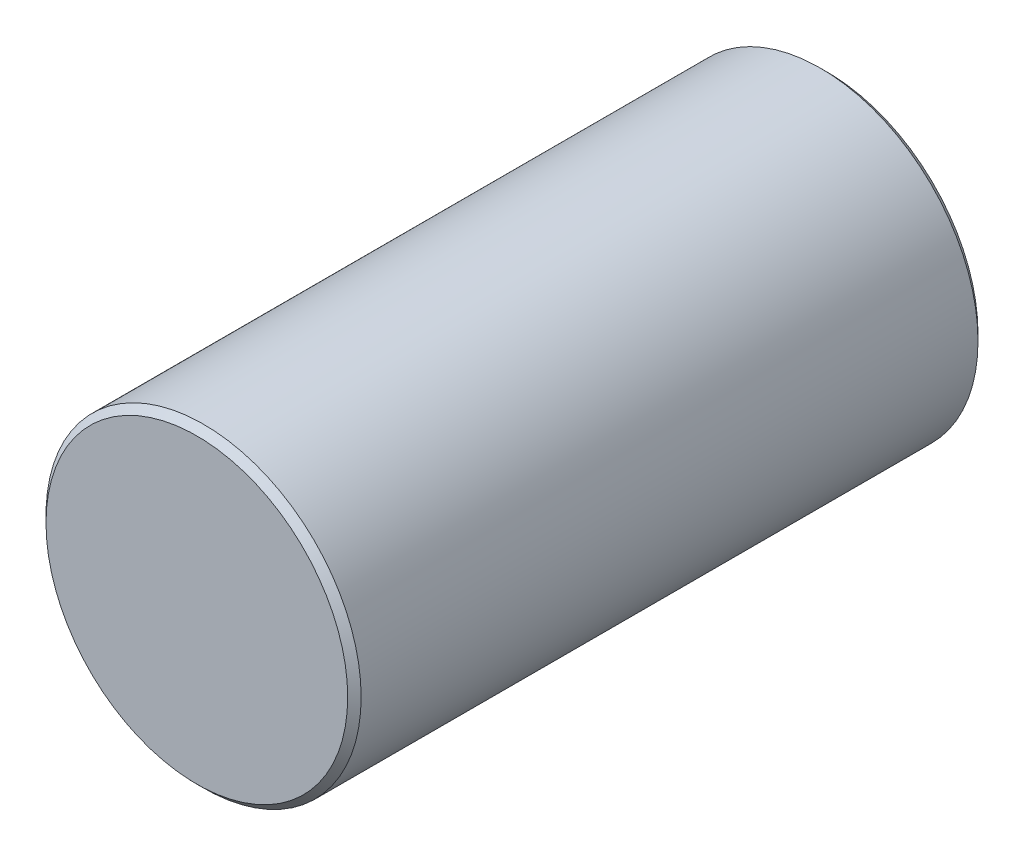
ISO-10303-21;
HEADER;
FILE_DESCRIPTION(('STEP AP214'),'2;1');
FILE_NAME('part.step','',(''),(''),'','','');
FILE_SCHEMA(('AUTOMOTIVE_DESIGN { 1 0 10303 214 1 1 1 1 }'));
ENDSEC;
DATA;
#1=APPLICATION_CONTEXT('core data for automotive mechanical design processes');
#2=APPLICATION_PROTOCOL_DEFINITION('international standard','automotive_design',2000,#1);
#3=PRODUCT_CONTEXT('',#1,'mechanical');
#4=PRODUCT('Part','Part','',(#3));
#5=PRODUCT_RELATED_PRODUCT_CATEGORY('part','',(#4));
#6=PRODUCT_DEFINITION_FORMATION('','',#4);
#7=PRODUCT_DEFINITION_CONTEXT('part definition',#1,'design');
#8=PRODUCT_DEFINITION('design','',#6,#7);
#9=PRODUCT_DEFINITION_SHAPE('','',#8);
#10=(LENGTH_UNIT() NAMED_UNIT(*) SI_UNIT(.MILLI.,.METRE.));
#11=(NAMED_UNIT(*) PLANE_ANGLE_UNIT() SI_UNIT($,.RADIAN.));
#12=(NAMED_UNIT(*) SI_UNIT($,.STERADIAN.) SOLID_ANGLE_UNIT());
#13=UNCERTAINTY_MEASURE_WITH_UNIT(LENGTH_MEASURE(1.E-05),#10,'distance_accuracy_value','');
#14=(GEOMETRIC_REPRESENTATION_CONTEXT(3) GLOBAL_UNCERTAINTY_ASSIGNED_CONTEXT((#13)) GLOBAL_UNIT_ASSIGNED_CONTEXT((#10,
#11,#12)) REPRESENTATION_CONTEXT('',''));
#15=CARTESIAN_POINT('',(0.,0.,0.));
#16=DIRECTION('',(0.,0.,1.));
#17=DIRECTION('',(1.,0.,0.));
#18=AXIS2_PLACEMENT_3D('',#15,#16,#17);
#19=CARTESIAN_POINT('',(0.,0.,19.05));
#20=DIRECTION('',(0.,0.,-1.));
#21=DIRECTION('',(-1.,0.,0.));
#22=AXIS2_PLACEMENT_3D('',#19,#20,#21);
#23=CYLINDRICAL_SURFACE('',#22,9.525);
#24=CARTESIAN_POINT('',(0.,0.,-18.6435999999999));
#25=DIRECTION('',(0.,0.,1.));
#26=DIRECTION('',(1.,0.,0.));
#27=AXIS2_PLACEMENT_3D('',#24,#25,#26);
#28=CIRCLE('',#27,9.525);
#29=CARTESIAN_POINT('',(9.525,0.,-18.6435999999999));
#30=VERTEX_POINT('',#29);
#31=EDGE_CURVE('E84',#30,#30,#28,.T.);
#32=ORIENTED_EDGE('',*,*,#31,.T.);
#33=EDGE_LOOP('',(#32));
#34=FACE_BOUND('',#33,.T.);
#35=CARTESIAN_POINT('',(0.,0.,18.6436));
#36=DIRECTION('',(0.,0.,1.));
#37=DIRECTION('',(1.,0.,0.));
#38=AXIS2_PLACEMENT_3D('',#35,#36,#37);
#39=CIRCLE('',#38,9.525);
#40=CARTESIAN_POINT('',(9.525,0.,18.6436));
#41=VERTEX_POINT('',#40);
#42=EDGE_CURVE('E88',#41,#41,#39,.F.);
#43=ORIENTED_EDGE('',*,*,#42,.T.);
#44=EDGE_LOOP('',(#43));
#45=FACE_BOUND('',#44,.T.);
#46=CARTESIAN_POINT('',(0.,-9.525,10.715625));
#47=CARTESIAN_POINT('',(0.110186853701386,-9.52499796048559,10.7156289329824));
#48=CARTESIAN_POINT('',(0.22042245336439,-9.5230684693038,10.7248335568285));
#49=CARTESIAN_POINT('',(0.437771089573852,-9.51555756572704,10.7613757173834));
#50=CARTESIAN_POINT('',(0.544881689203696,-9.50997337887931,10.7887270303211));
#51=CARTESIAN_POINT('',(0.752806997512505,-9.4957758584897,10.8606755971884));
#52=CARTESIAN_POINT('',(0.85362785952583,-9.48716554196074,10.9052556786482));
#53=CARTESIAN_POINT('',(1.04635352166196,-9.4678488539815,11.0103437540592));
#54=CARTESIAN_POINT('',(1.13825872096074,-9.45714257643735,11.0708510344599));
#55=CARTESIAN_POINT('',(1.31189463984028,-9.43463473789133,11.2070139400527));
#56=CARTESIAN_POINT('',(1.39347613760826,-9.42282065534544,11.2828578019607));
#57=CARTESIAN_POINT('',(1.54285597062141,-9.39951856586761,11.4471365214722));
#58=CARTESIAN_POINT('',(1.61065316515057,-9.38803058598984,11.5355724200972));
#59=CARTESIAN_POINT('',(1.73118512787581,-9.36655865120051,11.7236112504163));
#60=CARTESIAN_POINT('',(1.78376349305533,-9.35659077965039,11.8233164353981));
#61=CARTESIAN_POINT('',(1.87136276965051,-9.33946634531907,12.0303884546893));
#62=CARTESIAN_POINT('',(1.9063855726613,-9.33230947967264,12.1377544621275));
#63=CARTESIAN_POINT('',(1.95739131212307,-9.3217444531547,12.3554890643973));
#64=CARTESIAN_POINT('',(1.97363711343668,-9.31828459008686,12.4657935204439));
#65=CARTESIAN_POINT('',(1.98744455278288,-9.31534984012429,12.6876124880444));
#66=CARTESIAN_POINT('',(1.98500826795315,-9.31587451021558,12.7991268636987));
#67=CARTESIAN_POINT('',(1.9617327897155,-9.3208026423169,13.0182636319106));
#68=CARTESIAN_POINT('',(1.94119667056943,-9.32514222216842,13.1259198677122));
#69=CARTESIAN_POINT('',(1.88278362853788,-9.33711044715307,13.3362247715613));
#70=CARTESIAN_POINT('',(1.84490581426693,-9.34473926135591,13.4388731819001));
#71=CARTESIAN_POINT('',(1.75260005102111,-9.36249066449262,13.6371127251104));
#72=CARTESIAN_POINT('',(1.69805354023101,-9.37263101634617,13.7326469957367));
#73=CARTESIAN_POINT('',(1.57404228509877,-9.3942517539202,13.9133194940257));
#74=CARTESIAN_POINT('',(1.50457568696685,-9.40573230607678,13.9984564277771));
#75=CARTESIAN_POINT('',(1.35108143795551,-9.4290154785123,14.1576646632151));
#76=CARTESIAN_POINT('',(1.26679552554168,-9.44082000579164,14.231486918124));
#77=CARTESIAN_POINT('',(1.08690932067122,-9.46321589927014,14.3639864520385));
#78=CARTESIAN_POINT('',(0.991308858478398,-9.473807247265,14.4226635038));
#79=CARTESIAN_POINT('',(0.791218796711317,-9.49261295121719,14.5232597544383));
#80=CARTESIAN_POINT('',(0.686713545808314,-9.50082300540034,14.5651486772503));
#81=CARTESIAN_POINT('',(0.471939335793291,-9.51390874410408,14.6307043314263));
#82=CARTESIAN_POINT('',(0.361671137519699,-9.51878486758734,14.6543734617548));
#83=CARTESIAN_POINT('',(0.14063958680007,-9.52459161904536,14.6824608751578));
#84=CARTESIAN_POINT('',(0.0299212881478024,-9.52559203490906,14.6872197071221));
#85=CARTESIAN_POINT('',(-0.190728280527878,-9.52372924201278,14.678271141924));
#86=CARTESIAN_POINT('',(-0.300659598327591,-9.52086626982693,14.66456487547));
#87=CARTESIAN_POINT('',(-0.515503107802709,-9.51164221904454,14.6193579001171));
#88=CARTESIAN_POINT('',(-0.620454043719558,-9.50531583928072,14.5880336169537));
#89=CARTESIAN_POINT('',(-0.823613171574869,-9.48987223247301,14.508673896581));
#90=CARTESIAN_POINT('',(-0.921820826434637,-9.48075478344518,14.4606371301253));
#91=CARTESIAN_POINT('',(-1.1101297122728,-9.46056720866508,14.3484911495479));
#92=CARTESIAN_POINT('',(-1.20010748590837,-9.44947300177074,14.2841790618091));
#93=CARTESIAN_POINT('',(-1.36811614534486,-9.42661577175788,14.1415776936164));
#94=CARTESIAN_POINT('',(-1.44614563118735,-9.41485267048736,14.0632867776137));
#95=CARTESIAN_POINT('',(-1.58937110473474,-9.3917456394356,13.893394271513));
#96=CARTESIAN_POINT('',(-1.65433239427825,-9.38041191775658,13.801593186771));
#97=CARTESIAN_POINT('',(-1.76791491538299,-9.35967141612591,13.6081828988106));
#98=CARTESIAN_POINT('',(-1.8165368272611,-9.35026455595258,13.5065741041792));
#99=CARTESIAN_POINT('',(-1.89574878729727,-9.33452699874015,13.2969616008766));
#100=CARTESIAN_POINT('',(-1.92643616852001,-9.32817973045691,13.1889959784992));
#101=CARTESIAN_POINT('',(-1.96919911155909,-9.31924705726644,12.9692931010935));
#102=CARTESIAN_POINT('',(-1.981277335768,-9.31666111423332,12.8575563879291));
#103=CARTESIAN_POINT('',(-1.98637408299083,-9.31557552852254,12.6358437259131));
#104=CARTESIAN_POINT('',(-1.97976398913577,-9.31699626185384,12.5258765385225));
#105=CARTESIAN_POINT('',(-1.94849599686026,-9.32358510017197,12.3086590108392));
#106=CARTESIAN_POINT('',(-1.92383827166848,-9.32875316919031,12.2014086444794));
#107=CARTESIAN_POINT('',(-1.85734670707629,-9.34221735260749,11.9929310371236));
#108=CARTESIAN_POINT('',(-1.81556211639869,-9.35050449250089,11.891687471202));
#109=CARTESIAN_POINT('',(-1.71604713463365,-9.36927745360246,11.6975909430577));
#110=CARTESIAN_POINT('',(-1.6583152632306,-9.37976347890167,11.6047387608324));
#111=CARTESIAN_POINT('',(-1.52729199135608,-9.40199382537444,11.4282194170114));
#112=CARTESIAN_POINT('',(-1.45373390103893,-9.41375774516092,11.3447526397531));
#113=CARTESIAN_POINT('',(-1.29369254550809,-9.4370817033835,11.1912249295032));
#114=CARTESIAN_POINT('',(-1.20720630864734,-9.44864169425996,11.121167087137));
#115=CARTESIAN_POINT('',(-1.02256340366848,-9.47041293219374,10.9956781400703));
#116=CARTESIAN_POINT('',(-0.92428365041514,-9.48060708766275,10.9404250331805));
#117=CARTESIAN_POINT('',(-0.719645252347545,-9.49832854734372,10.8473077623673));
#118=CARTESIAN_POINT('',(-0.613293766277749,-9.50585818189085,10.8094283950988));
#119=CARTESIAN_POINT('',(-0.422299277478917,-9.51599093403041,10.7592173082171));
#120=CARTESIAN_POINT('',(-0.338721055043087,-9.51934906612464,10.7429002134059));
#121=CARTESIAN_POINT('',(-0.170104870255252,-9.52385434553741,10.7211027413347));
#122=CARTESIAN_POINT('',(-0.085066961960084,-9.52500157455531,10.7156219636408));
#123=CARTESIAN_POINT('',(0.,-9.525,10.715625));
#124=B_SPLINE_CURVE_WITH_KNOTS('',3,(#46,#47,#48,#49,#50,#51,#52,#53,#54,#55,#56,#57,#58,#59,
#60,#61,#62,#63,#64,#65,#66,#67,#68,#69,#70,#71,#72,#73,#74,#75,#76,#77,#78,#79,#80,#81,#82,#83,
#84,#85,#86,#87,#88,#89,#90,#91,#92,#93,#94,#95,#96,#97,#98,#99,#100,#101,#102,#103,#104,#105,
#106,#107,#108,#109,#110,#111,#112,#113,#114,#115,#116,#117,#118,#119,#120,#121,#122,#123),
.UNSPECIFIED.,.T.,.F.,(4,2,2,2,2,2,2,2,2,2,2,2,2,2,2,2,2,2,2,2,2,2,2,2,2,2,2,2,2,2,2,2,2,2,2,2,
2,2,4),(0.,0.330249284101304,0.660749567351132,0.990921276385388,1.32107819599712,
1.65556448141145,1.9900784358846,2.32791713070946,2.66571941590716,2.99873313082144,
3.33170982067874,3.65921468004882,3.98673637548069,4.31664415461589,4.64659294784255,
4.98299623089302,5.31940456116671,5.65641687643214,5.99338481035162,6.32425613809685,
6.65510720589241,6.98270267529287,7.31032420633107,7.64225014593232,7.97421494696261,
8.31169381329072,8.64915862638953,8.98477454525852,9.32034244345019,9.64928891974524,
9.97823223871661,10.3062362358679,10.6342706904185,10.9683395191812,11.3024852549882,
11.6404844723223,11.9781873476315,12.2331573420768,12.4881179144526),.UNSPECIFIED.);
#125=CARTESIAN_POINT('',(0.,-9.525,10.715625));
#126=VERTEX_POINT('',#125);
#127=EDGE_CURVE('E42',#126,#126,#124,.T.);
#128=ORIENTED_EDGE('',*,*,#127,.F.);
#129=EDGE_LOOP('',(#128));
#130=FACE_BOUND('',#129,.T.);
#131=CARTESIAN_POINT('',(0.,-9.525,-14.684375));
#132=CARTESIAN_POINT('',(0.110186853701386,-9.52499796048559,-14.6843710670176));
#133=CARTESIAN_POINT('',(0.22042245336439,-9.5230684693038,-14.6751664431715));
#134=CARTESIAN_POINT('',(0.437771089573852,-9.51555756572704,-14.6386242826166));
#135=CARTESIAN_POINT('',(0.544881689203696,-9.50997337887931,-14.6112729696789));
#136=CARTESIAN_POINT('',(0.752806997512506,-9.4957758584897,-14.5393244028116));
#137=CARTESIAN_POINT('',(0.853627859525832,-9.48716554196074,-14.4947443213518));
#138=CARTESIAN_POINT('',(1.04635352166196,-9.4678488539815,-14.3896562459408));
#139=CARTESIAN_POINT('',(1.13825872096074,-9.45714257643735,-14.3291489655401));
#140=CARTESIAN_POINT('',(1.31189463984028,-9.43463473789133,-14.1929860599473));
#141=CARTESIAN_POINT('',(1.39347613760826,-9.42282065534544,-14.1171421980393));
#142=CARTESIAN_POINT('',(1.54285597062141,-9.39951856586761,-13.9528634785278));
#143=CARTESIAN_POINT('',(1.61065316515057,-9.38803058598984,-13.8644275799028));
#144=CARTESIAN_POINT('',(1.73118512787581,-9.36655865120051,-13.6763887495837));
#145=CARTESIAN_POINT('',(1.78376349305533,-9.35659077965039,-13.5766835646019));
#146=CARTESIAN_POINT('',(1.87136276965051,-9.33946634531907,-13.3696115453107));
#147=CARTESIAN_POINT('',(1.9063855726613,-9.33230947967264,-13.2622455378725));
#148=CARTESIAN_POINT('',(1.95739131212307,-9.3217444531547,-13.0445109356027));
#149=CARTESIAN_POINT('',(1.97363711343668,-9.31828459008686,-12.9342064795561));
#150=CARTESIAN_POINT('',(1.98744455278288,-9.31534984012429,-12.7123875119556));
#151=CARTESIAN_POINT('',(1.98500826795315,-9.31587451021558,-12.6008731363013));
#152=CARTESIAN_POINT('',(1.9617327897155,-9.3208026423169,-12.3817363680894));
#153=CARTESIAN_POINT('',(1.94119667056943,-9.32514222216842,-12.2740801322878));
#154=CARTESIAN_POINT('',(1.88278362853788,-9.33711044715307,-12.0637752284387));
#155=CARTESIAN_POINT('',(1.84490581426693,-9.34473926135591,-11.9611268180999));
#156=CARTESIAN_POINT('',(1.75260005102111,-9.36249066449262,-11.7628872748896));
#157=CARTESIAN_POINT('',(1.69805354023101,-9.37263101634617,-11.6673530042633));
#158=CARTESIAN_POINT('',(1.57404228509877,-9.3942517539202,-11.4866805059743));
#159=CARTESIAN_POINT('',(1.50457568696685,-9.40573230607678,-11.4015435722229));
#160=CARTESIAN_POINT('',(1.35108143795551,-9.4290154785123,-11.2423353367849));
#161=CARTESIAN_POINT('',(1.26679552554168,-9.44082000579164,-11.168513081876));
#162=CARTESIAN_POINT('',(1.08690932067122,-9.46321589927014,-11.0360135479615));
#163=CARTESIAN_POINT('',(0.991308858478398,-9.473807247265,-10.9773364962));
#164=CARTESIAN_POINT('',(0.791218796711317,-9.49261295121719,-10.8767402455617));
#165=CARTESIAN_POINT('',(0.686713545808314,-9.50082300540034,-10.8348513227497));
#166=CARTESIAN_POINT('',(0.471939335793291,-9.51390874410408,-10.7692956685737));
#167=CARTESIAN_POINT('',(0.361671137519699,-9.51878486758734,-10.7456265382451));
#168=CARTESIAN_POINT('',(0.14063958680007,-9.52459161904536,-10.7175391248422));
#169=CARTESIAN_POINT('',(0.0299212881478024,-9.52559203490906,-10.7127802928779));
#170=CARTESIAN_POINT('',(-0.190728280527878,-9.52372924201278,-10.721728858076));
#171=CARTESIAN_POINT('',(-0.300659598327591,-9.52086626982693,-10.73543512453));
#172=CARTESIAN_POINT('',(-0.51550310780271,-9.51164221904454,-10.7806420998829));
#173=CARTESIAN_POINT('',(-0.620454043719558,-9.50531583928072,-10.8119663830463));
#174=CARTESIAN_POINT('',(-0.823613171574869,-9.48987223247301,-10.891326103419));
#175=CARTESIAN_POINT('',(-0.921820826434637,-9.48075478344518,-10.9393628698747));
#176=CARTESIAN_POINT('',(-1.1101297122728,-9.46056720866508,-11.0515088504521));
#177=CARTESIAN_POINT('',(-1.20010748590837,-9.44947300177074,-11.1158209381909));
#178=CARTESIAN_POINT('',(-1.36811614534486,-9.42661577175788,-11.2584223063836));
#179=CARTESIAN_POINT('',(-1.44614563118735,-9.41485267048736,-11.3367132223863));
#180=CARTESIAN_POINT('',(-1.58937110473474,-9.3917456394356,-11.506605728487));
#181=CARTESIAN_POINT('',(-1.65433239427825,-9.38041191775658,-11.598406813229));
#182=CARTESIAN_POINT('',(-1.76791491538299,-9.35967141612591,-11.7918171011894));
#183=CARTESIAN_POINT('',(-1.8165368272611,-9.35026455595258,-11.8934258958208));
#184=CARTESIAN_POINT('',(-1.89574878729727,-9.33452699874015,-12.1030383991234));
#185=CARTESIAN_POINT('',(-1.92643616852001,-9.32817973045691,-12.2110040215008));
#186=CARTESIAN_POINT('',(-1.96919911155909,-9.31924705726644,-12.4307068989065));
#187=CARTESIAN_POINT('',(-1.981277335768,-9.31666111423332,-12.5424436120709));
#188=CARTESIAN_POINT('',(-1.98637408299083,-9.31557552852254,-12.7641562740869));
#189=CARTESIAN_POINT('',(-1.97976398913577,-9.31699626185384,-12.8741234614775));
#190=CARTESIAN_POINT('',(-1.94849599686026,-9.32358510017197,-13.0913409891609));
#191=CARTESIAN_POINT('',(-1.92383827166848,-9.32875316919031,-13.1985913555206));
#192=CARTESIAN_POINT('',(-1.85734670707629,-9.34221735260749,-13.4070689628764));
#193=CARTESIAN_POINT('',(-1.81556211639869,-9.35050449250089,-13.508312528798));
#194=CARTESIAN_POINT('',(-1.71604713463365,-9.36927745360246,-13.7024090569423));
#195=CARTESIAN_POINT('',(-1.6583152632306,-9.37976347890167,-13.7952612391676));
#196=CARTESIAN_POINT('',(-1.52729199135608,-9.40199382537444,-13.9717805829886));
#197=CARTESIAN_POINT('',(-1.45373390103893,-9.41375774516092,-14.0552473602469));
#198=CARTESIAN_POINT('',(-1.29369254550809,-9.4370817033835,-14.2087750704968));
#199=CARTESIAN_POINT('',(-1.20720630864734,-9.44864169425996,-14.278832912863));
#200=CARTESIAN_POINT('',(-1.02256340366848,-9.47041293219374,-14.4043218599297));
#201=CARTESIAN_POINT('',(-0.924283650415141,-9.48060708766275,-14.4595749668195));
#202=CARTESIAN_POINT('',(-0.719645252347546,-9.49832854734372,-14.5526922376327));
#203=CARTESIAN_POINT('',(-0.61329376627775,-9.50585818189085,-14.5905716049012));
#204=CARTESIAN_POINT('',(-0.422299277478917,-9.51599093403042,-14.6407826917829));
#205=CARTESIAN_POINT('',(-0.338721055043087,-9.51934906612464,-14.6570997865941));
#206=CARTESIAN_POINT('',(-0.170104870255252,-9.52385434553741,-14.6788972586653));
#207=CARTESIAN_POINT('',(-0.085066961960084,-9.52500157455531,-14.6843780363592));
#208=CARTESIAN_POINT('',(0.,-9.525,-14.684375));
#209=B_SPLINE_CURVE_WITH_KNOTS('',3,(#131,#132,#133,#134,#135,#136,#137,#138,#139,#140,#141,
#142,#143,#144,#145,#146,#147,#148,#149,#150,#151,#152,#153,#154,#155,#156,#157,#158,#159,#160,
#161,#162,#163,#164,#165,#166,#167,#168,#169,#170,#171,#172,#173,#174,#175,#176,#177,#178,#179,
#180,#181,#182,#183,#184,#185,#186,#187,#188,#189,#190,#191,#192,#193,#194,#195,#196,#197,#198,
#199,#200,#201,#202,#203,#204,#205,#206,#207,#208),.UNSPECIFIED.,.T.,.F.,(4,2,2,2,2,2,2,2,2,2,2,
2,2,2,2,2,2,2,2,2,2,2,2,2,2,2,2,2,2,2,2,2,2,2,2,2,2,2,4),(0.,0.330249284101303,
0.660749567351132,0.990921276385392,1.32107819599712,1.65556448141145,1.9900784358846,
2.32791713070946,2.66571941590716,2.99873313082144,3.33170982067874,3.65921468004882,
3.98673637548069,4.31664415461589,4.64659294784255,4.98299623089302,5.31940456116671,
5.65641687643214,5.99338481035162,6.32425613809685,6.65510720589241,6.98270267529287,
7.31032420633107,7.64225014593232,7.97421494696261,8.31169381329072,8.64915862638953,
8.98477454525853,9.32034244345019,9.64928891974524,9.97823223871661,10.3062362358679,
10.6342706904185,10.9683395191812,11.3024852549882,11.6404844723223,11.9781873476315,
12.2331573420768,12.4881179144526),.UNSPECIFIED.);
#210=CARTESIAN_POINT('',(0.,-9.525,-14.684375));
#211=VERTEX_POINT('',#210);
#212=EDGE_CURVE('E10',#211,#211,#209,.T.);
#213=ORIENTED_EDGE('',*,*,#212,.F.);
#214=EDGE_LOOP('',(#213));
#215=FACE_BOUND('',#214,.T.);
#216=ADVANCED_FACE('F31',(#34,#45,#130,#215),#23,.T.);
#217=CARTESIAN_POINT('',(0.,0.,19.05));
#218=DIRECTION('',(0.,0.,1.));
#219=DIRECTION('',(1.,0.,0.));
#220=AXIS2_PLACEMENT_3D('',#217,#218,#219);
#221=PLANE('',#220);
#222=CARTESIAN_POINT('',(0.,0.,19.05));
#223=DIRECTION('',(0.,0.,1.));
#224=DIRECTION('',(1.,0.,0.));
#225=AXIS2_PLACEMENT_3D('',#222,#223,#224);
#226=CIRCLE('',#225,9.11860000000003);
#227=CARTESIAN_POINT('',(9.11860000000003,0.,19.05));
#228=VERTEX_POINT('',#227);
#229=EDGE_CURVE('E46',#228,#228,#226,.T.);
#230=ORIENTED_EDGE('',*,*,#229,.T.);
#231=EDGE_LOOP('',(#230));
#232=FACE_BOUND('',#231,.T.);
#233=ADVANCED_FACE('F65',(#232),#221,.T.);
#234=CARTESIAN_POINT('',(0.,0.,-19.05));
#235=DIRECTION('',(0.,0.,1.));
#236=DIRECTION('',(1.,0.,0.));
#237=AXIS2_PLACEMENT_3D('',#234,#235,#236);
#238=PLANE('',#237);
#239=CARTESIAN_POINT('',(0.,0.,-19.05));
#240=DIRECTION('',(0.,0.,1.));
#241=DIRECTION('',(1.,0.,0.));
#242=AXIS2_PLACEMENT_3D('',#239,#240,#241);
#243=CIRCLE('',#242,9.11859999999995);
#244=CARTESIAN_POINT('',(9.11859999999995,0.,-19.05));
#245=VERTEX_POINT('',#244);
#246=EDGE_CURVE('E50',#245,#245,#243,.F.);
#247=ORIENTED_EDGE('',*,*,#246,.T.);
#248=EDGE_LOOP('',(#247));
#249=FACE_BOUND('',#248,.T.);
#250=ADVANCED_FACE('F67',(#249),#238,.F.);
#251=CARTESIAN_POINT('',(0.,0.,-18.6435999999999));
#252=DIRECTION('',(0.,0.,1.));
#253=DIRECTION('',(1.,0.,0.));
#254=AXIS2_PLACEMENT_3D('',#251,#252,#253);
#255=CONICAL_SURFACE('',#254,9.525,0.78539816339744);
#256=ORIENTED_EDGE('',*,*,#246,.F.);
#257=EDGE_LOOP('',(#256));
#258=FACE_BOUND('',#257,.T.);
#259=ORIENTED_EDGE('',*,*,#31,.F.);
#260=EDGE_LOOP('',(#259));
#261=FACE_BOUND('',#260,.T.);
#262=ADVANCED_FACE('F70',(#258,#261),#255,.T.);
#263=CARTESIAN_POINT('',(0.,0.,19.05));
#264=DIRECTION('',(0.,0.,-1.));
#265=DIRECTION('',(-1.,0.,0.));
#266=AXIS2_PLACEMENT_3D('',#263,#264,#265);
#267=CONICAL_SURFACE('',#266,9.11860000000003,0.785398163397448);
#268=ORIENTED_EDGE('',*,*,#42,.F.);
#269=EDGE_LOOP('',(#268));
#270=FACE_BOUND('',#269,.T.);
#271=ORIENTED_EDGE('',*,*,#229,.F.);
#272=EDGE_LOOP('',(#271));
#273=FACE_BOUND('',#272,.T.);
#274=ADVANCED_FACE('F33',(#270,#273),#267,.T.);
#275=CARTESIAN_POINT('',(0.,3.175,12.7));
#276=DIRECTION('',(0.,-1.,0.));
#277=DIRECTION('',(0.,0.,-1.));
#278=AXIS2_PLACEMENT_3D('',#275,#276,#277);
#279=CYLINDRICAL_SURFACE('',#278,1.984375);
#280=CARTESIAN_POINT('',(0.,3.175,12.7));
#281=DIRECTION('',(0.,1.,0.));
#282=DIRECTION('',(0.,0.,1.));
#283=AXIS2_PLACEMENT_3D('',#280,#281,#282);
#284=CIRCLE('',#283,1.984375);
#285=CARTESIAN_POINT('',(0.,3.175,14.684375));
#286=VERTEX_POINT('',#285);
#287=EDGE_CURVE('E91',#286,#286,#284,.T.);
#288=ORIENTED_EDGE('',*,*,#287,.T.);
#289=EDGE_LOOP('',(#288));
#290=FACE_BOUND('',#289,.T.);
#291=ORIENTED_EDGE('',*,*,#127,.T.);
#292=EDGE_LOOP('',(#291));
#293=FACE_BOUND('',#292,.T.);
#294=ADVANCED_FACE('F58',(#290,#293),#279,.F.);
#295=CARTESIAN_POINT('',(0.,3.175,12.7));
#296=DIRECTION('',(0.,1.,0.));
#297=DIRECTION('',(0.,0.,1.));
#298=AXIS2_PLACEMENT_3D('',#295,#296,#297);
#299=PLANE('',#298);
#300=ORIENTED_EDGE('',*,*,#287,.F.);
#301=EDGE_LOOP('',(#300));
#302=FACE_BOUND('',#301,.T.);
#303=ADVANCED_FACE('F63',(#302),#299,.F.);
#304=CARTESIAN_POINT('',(0.,3.175,-12.7));
#305=DIRECTION('',(0.,-1.,0.));
#306=DIRECTION('',(0.,0.,-1.));
#307=AXIS2_PLACEMENT_3D('',#304,#305,#306);
#308=CYLINDRICAL_SURFACE('',#307,1.984375);
#309=CARTESIAN_POINT('',(0.,3.175,-12.7));
#310=DIRECTION('',(0.,1.,0.));
#311=DIRECTION('',(0.,0.,1.));
#312=AXIS2_PLACEMENT_3D('',#309,#310,#311);
#313=CIRCLE('',#312,1.984375);
#314=CARTESIAN_POINT('',(0.,3.175,-10.715625));
#315=VERTEX_POINT('',#314);
#316=EDGE_CURVE('E95',#315,#315,#313,.T.);
#317=ORIENTED_EDGE('',*,*,#316,.T.);
#318=EDGE_LOOP('',(#317));
#319=FACE_BOUND('',#318,.T.);
#320=ORIENTED_EDGE('',*,*,#212,.T.);
#321=EDGE_LOOP('',(#320));
#322=FACE_BOUND('',#321,.T.);
#323=ADVANCED_FACE('F103',(#319,#322),#308,.F.);
#324=CARTESIAN_POINT('',(0.,3.175,-12.7));
#325=DIRECTION('',(0.,1.,0.));
#326=DIRECTION('',(0.,0.,1.));
#327=AXIS2_PLACEMENT_3D('',#324,#325,#326);
#328=PLANE('',#327);
#329=ORIENTED_EDGE('',*,*,#316,.F.);
#330=EDGE_LOOP('',(#329));
#331=FACE_BOUND('',#330,.T.);
#332=ADVANCED_FACE('F105',(#331),#328,.F.);
#333=CLOSED_SHELL('',(#216,#233,#250,#262,#274,#294,#303,#323,#332));
#334=MANIFOLD_SOLID_BREP('B2',#333);
#335=ADVANCED_BREP_SHAPE_REPRESENTATION('',(#18,#334),#14);
#336=SHAPE_DEFINITION_REPRESENTATION(#9,#335);
ENDSEC;
END-ISO-10303-21;
